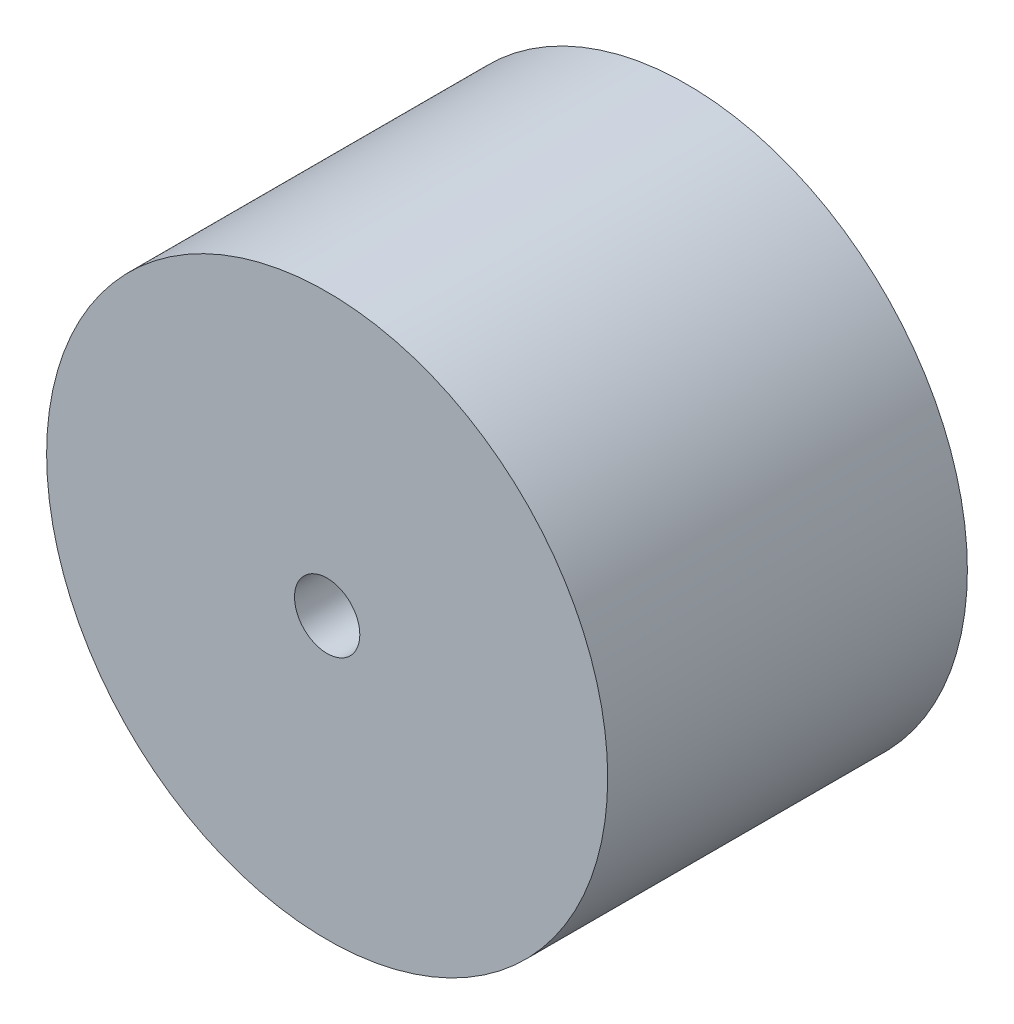
ISO-10303-21;
HEADER;
FILE_DESCRIPTION(('STEP AP214'),'2;1');
FILE_NAME('part.step','',(''),(''),'','','');
FILE_SCHEMA(('AUTOMOTIVE_DESIGN { 1 0 10303 214 1 1 1 1 }'));
ENDSEC;
DATA;
#1=APPLICATION_CONTEXT('core data for automotive mechanical design processes');
#2=APPLICATION_PROTOCOL_DEFINITION('international standard','automotive_design',2000,#1);
#3=PRODUCT_CONTEXT('',#1,'mechanical');
#4=PRODUCT('Part','Part','',(#3));
#5=PRODUCT_RELATED_PRODUCT_CATEGORY('part','',(#4));
#6=PRODUCT_DEFINITION_FORMATION('','',#4);
#7=PRODUCT_DEFINITION_CONTEXT('part definition',#1,'design');
#8=PRODUCT_DEFINITION('design','',#6,#7);
#9=PRODUCT_DEFINITION_SHAPE('','',#8);
#10=(LENGTH_UNIT() NAMED_UNIT(*) SI_UNIT(.MILLI.,.METRE.));
#11=(NAMED_UNIT(*) PLANE_ANGLE_UNIT() SI_UNIT($,.RADIAN.));
#12=(NAMED_UNIT(*) SI_UNIT($,.STERADIAN.) SOLID_ANGLE_UNIT());
#13=UNCERTAINTY_MEASURE_WITH_UNIT(LENGTH_MEASURE(1.E-05),#10,'distance_accuracy_value','');
#14=(GEOMETRIC_REPRESENTATION_CONTEXT(3) GLOBAL_UNCERTAINTY_ASSIGNED_CONTEXT((#13)) GLOBAL_UNIT_ASSIGNED_CONTEXT((#10,
#11,#12)) REPRESENTATION_CONTEXT('',''));
#15=CARTESIAN_POINT('',(0.,0.,0.));
#16=DIRECTION('',(0.,0.,1.));
#17=DIRECTION('',(1.,0.,0.));
#18=AXIS2_PLACEMENT_3D('',#15,#16,#17);
#19=CARTESIAN_POINT('',(0.,0.,5.));
#20=DIRECTION('',(0.,0.,-1.));
#21=DIRECTION('',(-1.,0.,0.));
#22=AXIS2_PLACEMENT_3D('',#19,#20,#21);
#23=CYLINDRICAL_SURFACE('',#22,3.9);
#24=CARTESIAN_POINT('',(0.,0.,5.));
#25=DIRECTION('',(0.,0.,1.));
#26=DIRECTION('',(1.,0.,0.));
#27=AXIS2_PLACEMENT_3D('',#24,#25,#26);
#28=CIRCLE('',#27,3.9);
#29=CARTESIAN_POINT('',(3.9,0.,5.));
#30=VERTEX_POINT('',#29);
#31=EDGE_CURVE('E10',#30,#30,#28,.T.);
#32=ORIENTED_EDGE('',*,*,#31,.F.);
#33=EDGE_LOOP('',(#32));
#34=FACE_BOUND('',#33,.T.);
#35=CARTESIAN_POINT('',(0.,0.,0.));
#36=DIRECTION('',(0.,0.,1.));
#37=DIRECTION('',(1.,0.,0.));
#38=AXIS2_PLACEMENT_3D('',#35,#36,#37);
#39=CIRCLE('',#38,3.9);
#40=CARTESIAN_POINT('',(3.9,0.,0.));
#41=VERTEX_POINT('',#40);
#42=EDGE_CURVE('E35',#41,#41,#39,.T.);
#43=ORIENTED_EDGE('',*,*,#42,.T.);
#44=EDGE_LOOP('',(#43));
#45=FACE_BOUND('',#44,.T.);
#46=ADVANCED_FACE('F32',(#34,#45),#23,.T.);
#47=CARTESIAN_POINT('',(0.,0.,5.));
#48=DIRECTION('',(0.,0.,1.));
#49=DIRECTION('',(1.,0.,0.));
#50=AXIS2_PLACEMENT_3D('',#47,#48,#49);
#51=PLANE('',#50);
#52=CARTESIAN_POINT('',(0.,0.,5.));
#53=DIRECTION('',(0.,0.,1.));
#54=DIRECTION('',(1.,0.,0.));
#55=AXIS2_PLACEMENT_3D('',#52,#53,#54);
#56=CIRCLE('',#55,0.454);
#57=CARTESIAN_POINT('',(0.454,0.,5.));
#58=VERTEX_POINT('',#57);
#59=EDGE_CURVE('E44',#58,#58,#56,.T.);
#60=ORIENTED_EDGE('',*,*,#59,.F.);
#61=EDGE_LOOP('',(#60));
#62=FACE_BOUND('',#61,.T.);
#63=ORIENTED_EDGE('',*,*,#31,.T.);
#64=EDGE_LOOP('',(#63));
#65=FACE_BOUND('',#64,.T.);
#66=ADVANCED_FACE('F59',(#62,#65),#51,.T.);
#67=CARTESIAN_POINT('',(0.,0.,0.));
#68=DIRECTION('',(0.,0.,1.));
#69=DIRECTION('',(1.,0.,0.));
#70=AXIS2_PLACEMENT_3D('',#67,#68,#69);
#71=PLANE('',#70);
#72=CARTESIAN_POINT('',(0.,0.,0.));
#73=DIRECTION('',(0.,0.,1.));
#74=DIRECTION('',(1.,0.,0.));
#75=AXIS2_PLACEMENT_3D('',#72,#73,#74);
#76=CIRCLE('',#75,0.454);
#77=CARTESIAN_POINT('',(0.454,0.,0.));
#78=VERTEX_POINT('',#77);
#79=EDGE_CURVE('E42',#78,#78,#76,.T.);
#80=ORIENTED_EDGE('',*,*,#79,.T.);
#81=EDGE_LOOP('',(#80));
#82=FACE_BOUND('',#81,.T.);
#83=ORIENTED_EDGE('',*,*,#42,.F.);
#84=EDGE_LOOP('',(#83));
#85=FACE_BOUND('',#84,.T.);
#86=ADVANCED_FACE('F50',(#82,#85),#71,.F.);
#87=CARTESIAN_POINT('',(0.,0.,0.));
#88=DIRECTION('',(0.,0.,1.));
#89=DIRECTION('',(1.,0.,0.));
#90=AXIS2_PLACEMENT_3D('',#87,#88,#89);
#91=CYLINDRICAL_SURFACE('',#90,0.454);
#92=ORIENTED_EDGE('',*,*,#79,.F.);
#93=EDGE_LOOP('',(#92));
#94=FACE_BOUND('',#93,.T.);
#95=ORIENTED_EDGE('',*,*,#59,.T.);
#96=EDGE_LOOP('',(#95));
#97=FACE_BOUND('',#96,.T.);
#98=ADVANCED_FACE('F53',(#94,#97),#91,.F.);
#99=CLOSED_SHELL('',(#46,#66,#86,#98));
#100=MANIFOLD_SOLID_BREP('B2',#99);
#101=ADVANCED_BREP_SHAPE_REPRESENTATION('',(#18,#100),#14);
#102=SHAPE_DEFINITION_REPRESENTATION(#9,#101);
ENDSEC;
END-ISO-10303-21;
